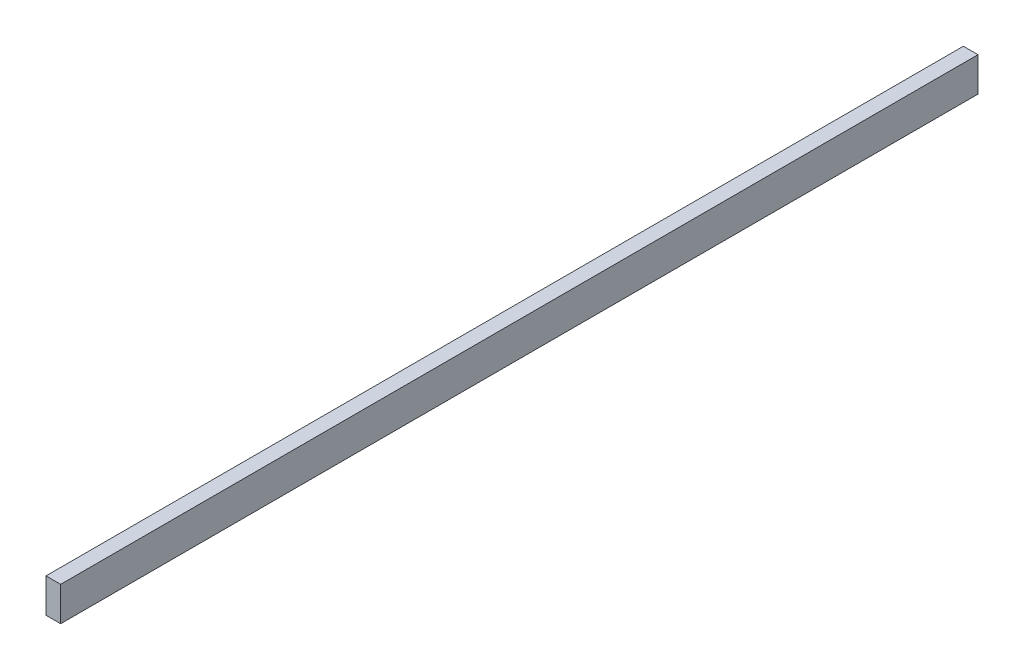
ISO-10303-21;
HEADER;
FILE_DESCRIPTION(('STEP AP214'),'2;1');
FILE_NAME('part.step','',(''),(''),'','','');
FILE_SCHEMA(('AUTOMOTIVE_DESIGN { 1 0 10303 214 1 1 1 1 }'));
ENDSEC;
DATA;
#1=APPLICATION_CONTEXT('core data for automotive mechanical design processes');
#2=APPLICATION_PROTOCOL_DEFINITION('international standard','automotive_design',2000,#1);
#3=PRODUCT_CONTEXT('',#1,'mechanical');
#4=PRODUCT('Part','Part','',(#3));
#5=PRODUCT_RELATED_PRODUCT_CATEGORY('part','',(#4));
#6=PRODUCT_DEFINITION_FORMATION('','',#4);
#7=PRODUCT_DEFINITION_CONTEXT('part definition',#1,'design');
#8=PRODUCT_DEFINITION('design','',#6,#7);
#9=PRODUCT_DEFINITION_SHAPE('','',#8);
#10=(LENGTH_UNIT() NAMED_UNIT(*) SI_UNIT(.MILLI.,.METRE.));
#11=(NAMED_UNIT(*) PLANE_ANGLE_UNIT() SI_UNIT($,.RADIAN.));
#12=(NAMED_UNIT(*) SI_UNIT($,.STERADIAN.) SOLID_ANGLE_UNIT());
#13=UNCERTAINTY_MEASURE_WITH_UNIT(LENGTH_MEASURE(1.E-05),#10,'distance_accuracy_value','');
#14=(GEOMETRIC_REPRESENTATION_CONTEXT(3) GLOBAL_UNCERTAINTY_ASSIGNED_CONTEXT((#13)) GLOBAL_UNIT_ASSIGNED_CONTEXT((#10,
#11,#12)) REPRESENTATION_CONTEXT('',''));
#15=CARTESIAN_POINT('',(0.,0.,0.));
#16=DIRECTION('',(0.,0.,1.));
#17=DIRECTION('',(1.,0.,0.));
#18=AXIS2_PLACEMENT_3D('',#15,#16,#17);
#19=CARTESIAN_POINT('',(38.1,44.45,-1193.8));
#20=DIRECTION('',(0.,0.,1.));
#21=DIRECTION('',(1.,0.,0.));
#22=AXIS2_PLACEMENT_3D('',#19,#20,#21);
#23=PLANE('',#22);
#24=DIRECTION('',(0.,1.,0.));
#25=VECTOR('',#24,1.);
#26=CARTESIAN_POINT('',(0.,44.45,-1193.8));
#27=LINE('',#26,#25);
#28=CARTESIAN_POINT('',(0.,-44.45,-1193.8));
#29=VERTEX_POINT('',#28);
#30=CARTESIAN_POINT('',(0.,44.45,-1193.8));
#31=VERTEX_POINT('',#30);
#32=EDGE_CURVE('E96',#29,#31,#27,.T.);
#33=ORIENTED_EDGE('',*,*,#32,.T.);
#34=DIRECTION('',(-1.,0.,0.));
#35=VECTOR('',#34,1.);
#36=CARTESIAN_POINT('',(38.1,44.45,-1193.8));
#37=LINE('',#36,#35);
#38=CARTESIAN_POINT('',(38.1,44.45,-1193.8));
#39=VERTEX_POINT('',#38);
#40=EDGE_CURVE('E11',#39,#31,#37,.T.);
#41=ORIENTED_EDGE('',*,*,#40,.F.);
#42=DIRECTION('',(0.,1.,0.));
#43=VECTOR('',#42,1.);
#44=CARTESIAN_POINT('',(38.1,44.45,-1193.8));
#45=LINE('',#44,#43);
#46=CARTESIAN_POINT('',(38.1,-44.45,-1193.8));
#47=VERTEX_POINT('',#46);
#48=EDGE_CURVE('E84',#47,#39,#45,.T.);
#49=ORIENTED_EDGE('',*,*,#48,.F.);
#50=DIRECTION('',(-1.,0.,0.));
#51=VECTOR('',#50,1.);
#52=CARTESIAN_POINT('',(38.1,-44.45,-1193.8));
#53=LINE('',#52,#51);
#54=EDGE_CURVE('E92',#47,#29,#53,.T.);
#55=ORIENTED_EDGE('',*,*,#54,.T.);
#56=EDGE_LOOP('',(#33,#41,#49,#55));
#57=FACE_BOUND('',#56,.T.);
#58=ADVANCED_FACE('F33',(#57),#23,.F.);
#59=CARTESIAN_POINT('',(38.1,44.45,1193.8));
#60=DIRECTION('',(0.,-1.,0.));
#61=DIRECTION('',(0.,0.,-1.));
#62=AXIS2_PLACEMENT_3D('',#59,#60,#61);
#63=PLANE('',#62);
#64=DIRECTION('',(0.,0.,1.));
#65=VECTOR('',#64,1.);
#66=CARTESIAN_POINT('',(0.,44.45,1193.8));
#67=LINE('',#66,#65);
#68=CARTESIAN_POINT('',(0.,44.45,1193.8));
#69=VERTEX_POINT('',#68);
#70=EDGE_CURVE('E88',#31,#69,#67,.T.);
#71=ORIENTED_EDGE('',*,*,#70,.T.);
#72=DIRECTION('',(-1.,0.,0.));
#73=VECTOR('',#72,1.);
#74=CARTESIAN_POINT('',(38.1,44.45,1193.8));
#75=LINE('',#74,#73);
#76=CARTESIAN_POINT('',(38.1,44.45,1193.8));
#77=VERTEX_POINT('',#76);
#78=EDGE_CURVE('E41',#77,#69,#75,.T.);
#79=ORIENTED_EDGE('',*,*,#78,.F.);
#80=DIRECTION('',(0.,0.,1.));
#81=VECTOR('',#80,1.);
#82=CARTESIAN_POINT('',(38.1,44.45,1193.8));
#83=LINE('',#82,#81);
#84=EDGE_CURVE('E79',#39,#77,#83,.T.);
#85=ORIENTED_EDGE('',*,*,#84,.F.);
#86=ORIENTED_EDGE('',*,*,#40,.T.);
#87=EDGE_LOOP('',(#71,#79,#85,#86));
#88=FACE_BOUND('',#87,.T.);
#89=ADVANCED_FACE('F87',(#88),#63,.F.);
#90=CARTESIAN_POINT('',(38.1,44.45,1193.8));
#91=DIRECTION('',(0.,0.,-1.));
#92=DIRECTION('',(-1.,0.,0.));
#93=AXIS2_PLACEMENT_3D('',#90,#91,#92);
#94=PLANE('',#93);
#95=DIRECTION('',(0.,-1.,0.));
#96=VECTOR('',#95,1.);
#97=CARTESIAN_POINT('',(0.,44.45,1193.8));
#98=LINE('',#97,#96);
#99=CARTESIAN_POINT('',(0.,-44.45,1193.8));
#100=VERTEX_POINT('',#99);
#101=EDGE_CURVE('E66',#69,#100,#98,.T.);
#102=ORIENTED_EDGE('',*,*,#101,.T.);
#103=DIRECTION('',(-1.,0.,0.));
#104=VECTOR('',#103,1.);
#105=CARTESIAN_POINT('',(38.1,-44.45,1193.8));
#106=LINE('',#105,#104);
#107=CARTESIAN_POINT('',(38.1,-44.45,1193.8));
#108=VERTEX_POINT('',#107);
#109=EDGE_CURVE('E89',#108,#100,#106,.T.);
#110=ORIENTED_EDGE('',*,*,#109,.F.);
#111=DIRECTION('',(0.,-1.,0.));
#112=VECTOR('',#111,1.);
#113=CARTESIAN_POINT('',(38.1,44.45,1193.8));
#114=LINE('',#113,#112);
#115=EDGE_CURVE('E82',#77,#108,#114,.T.);
#116=ORIENTED_EDGE('',*,*,#115,.F.);
#117=ORIENTED_EDGE('',*,*,#78,.T.);
#118=EDGE_LOOP('',(#102,#110,#116,#117));
#119=FACE_BOUND('',#118,.T.);
#120=ADVANCED_FACE('F90',(#119),#94,.F.);
#121=CARTESIAN_POINT('',(38.1,-44.45,1193.8));
#122=DIRECTION('',(0.,1.,0.));
#123=DIRECTION('',(0.,0.,1.));
#124=AXIS2_PLACEMENT_3D('',#121,#122,#123);
#125=PLANE('',#124);
#126=DIRECTION('',(0.,0.,-1.));
#127=VECTOR('',#126,1.);
#128=CARTESIAN_POINT('',(0.,-44.45,1193.8));
#129=LINE('',#128,#127);
#130=EDGE_CURVE('E72',#100,#29,#129,.T.);
#131=ORIENTED_EDGE('',*,*,#130,.T.);
#132=ORIENTED_EDGE('',*,*,#54,.F.);
#133=DIRECTION('',(0.,0.,-1.));
#134=VECTOR('',#133,1.);
#135=CARTESIAN_POINT('',(38.1,-44.45,1193.8));
#136=LINE('',#135,#134);
#137=EDGE_CURVE('E49',#108,#47,#136,.T.);
#138=ORIENTED_EDGE('',*,*,#137,.F.);
#139=ORIENTED_EDGE('',*,*,#109,.T.);
#140=EDGE_LOOP('',(#131,#132,#138,#139));
#141=FACE_BOUND('',#140,.T.);
#142=ADVANCED_FACE('F103',(#141),#125,.F.);
#143=CARTESIAN_POINT('',(38.1,0.,0.));
#144=DIRECTION('',(1.,0.,0.));
#145=DIRECTION('',(0.,0.,-1.));
#146=AXIS2_PLACEMENT_3D('',#143,#144,#145);
#147=PLANE('',#146);
#148=ORIENTED_EDGE('',*,*,#48,.T.);
#149=ORIENTED_EDGE('',*,*,#84,.T.);
#150=ORIENTED_EDGE('',*,*,#115,.T.);
#151=ORIENTED_EDGE('',*,*,#137,.T.);
#152=EDGE_LOOP('',(#148,#149,#150,#151));
#153=FACE_BOUND('',#152,.T.);
#154=ADVANCED_FACE('F80',(#153),#147,.T.);
#155=CARTESIAN_POINT('',(0.,0.,0.));
#156=DIRECTION('',(1.,0.,0.));
#157=DIRECTION('',(0.,0.,-1.));
#158=AXIS2_PLACEMENT_3D('',#155,#156,#157);
#159=PLANE('',#158);
#160=ORIENTED_EDGE('',*,*,#32,.F.);
#161=ORIENTED_EDGE('',*,*,#130,.F.);
#162=ORIENTED_EDGE('',*,*,#101,.F.);
#163=ORIENTED_EDGE('',*,*,#70,.F.);
#164=EDGE_LOOP('',(#160,#161,#162,#163));
#165=FACE_BOUND('',#164,.T.);
#166=ADVANCED_FACE('F106',(#165),#159,.F.);
#167=CLOSED_SHELL('',(#58,#89,#120,#142,#154,#166));
#168=MANIFOLD_SOLID_BREP('B2',#167);
#169=ADVANCED_BREP_SHAPE_REPRESENTATION('',(#18,#168),#14);
#170=SHAPE_DEFINITION_REPRESENTATION(#9,#169);
ENDSEC;
END-ISO-10303-21;
